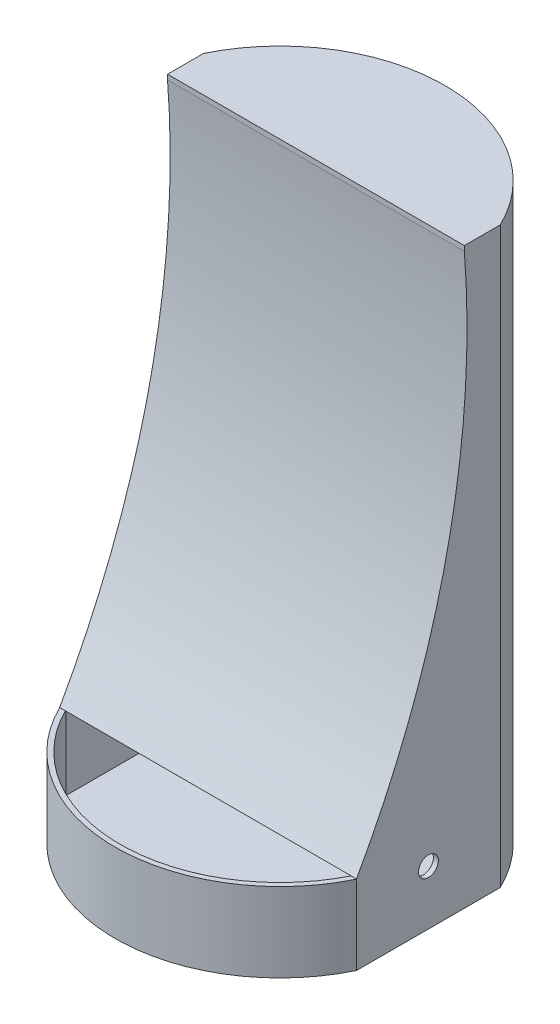
ISO-10303-21;
HEADER;
FILE_DESCRIPTION(('STEP AP214'),'2;1');
FILE_NAME('part.step','',(''),(''),'','','');
FILE_SCHEMA(('AUTOMOTIVE_DESIGN { 1 0 10303 214 1 1 1 1 }'));
ENDSEC;
DATA;
#1=APPLICATION_CONTEXT('core data for automotive mechanical design processes');
#2=APPLICATION_PROTOCOL_DEFINITION('international standard','automotive_design',2000,#1);
#3=PRODUCT_CONTEXT('',#1,'mechanical');
#4=PRODUCT('Part','Part','',(#3));
#5=PRODUCT_RELATED_PRODUCT_CATEGORY('part','',(#4));
#6=PRODUCT_DEFINITION_FORMATION('','',#4);
#7=PRODUCT_DEFINITION_CONTEXT('part definition',#1,'design');
#8=PRODUCT_DEFINITION('design','',#6,#7);
#9=PRODUCT_DEFINITION_SHAPE('','',#8);
#10=(LENGTH_UNIT() NAMED_UNIT(*) SI_UNIT(.MILLI.,.METRE.));
#11=(NAMED_UNIT(*) PLANE_ANGLE_UNIT() SI_UNIT($,.RADIAN.));
#12=(NAMED_UNIT(*) SI_UNIT($,.STERADIAN.) SOLID_ANGLE_UNIT());
#13=UNCERTAINTY_MEASURE_WITH_UNIT(LENGTH_MEASURE(1.E-05),#10,'distance_accuracy_value','');
#14=(GEOMETRIC_REPRESENTATION_CONTEXT(3) GLOBAL_UNCERTAINTY_ASSIGNED_CONTEXT((#13)) GLOBAL_UNIT_ASSIGNED_CONTEXT((#10,
#11,#12)) REPRESENTATION_CONTEXT('',''));
#15=CARTESIAN_POINT('',(0.,0.,0.));
#16=DIRECTION('',(0.,0.,1.));
#17=DIRECTION('',(1.,0.,0.));
#18=AXIS2_PLACEMENT_3D('',#15,#16,#17);
#19=CARTESIAN_POINT('',(87.,48.,-42.8952211790544));
#20=DIRECTION('',(1.,0.,0.));
#21=DIRECTION('',(0.,0.,-1.));
#22=AXIS2_PLACEMENT_3D('',#19,#20,#21);
#23=PLANE('',#22);
#24=CARTESIAN_POINT('',(87.,33.,0.));
#25=DIRECTION('',(1.,0.,0.));
#26=DIRECTION('',(0.,0.,-1.));
#27=AXIS2_PLACEMENT_3D('',#24,#25,#26);
#28=CIRCLE('',#27,6.);
#29=CARTESIAN_POINT('',(87.,33.,-6.00000000000001));
#30=VERTEX_POINT('',#29);
#31=EDGE_CURVE('E304',#30,#30,#28,.T.);
#32=ORIENTED_EDGE('',*,*,#31,.T.);
#33=EDGE_LOOP('',(#32));
#34=FACE_BOUND('',#33,.T.);
#35=DIRECTION('',(0.,-0.83062562422528,0.55683127819867));
#36=VECTOR('',#35,1.);
#37=CARTESIAN_POINT('',(87.,88.0542581905071,16.8537450068936));
#38=LINE('',#37,#36);
#39=CARTESIAN_POINT('',(87.,50.6279210575118,41.9434539398412));
#40=VERTEX_POINT('',#39);
#41=CARTESIAN_POINT('',(87.,49.0667688825623,42.990012504478));
#42=VERTEX_POINT('',#41);
#43=EDGE_CURVE('E238',#40,#42,#38,.T.);
#44=ORIENTED_EDGE('',*,*,#43,.F.);
#45=CARTESIAN_POINT('',(87.0000000000001,304.085663032172,498.891262140153));
#46=DIRECTION('',(1.,0.,0.));
#47=DIRECTION('',(0.,0.,-1.));
#48=AXIS2_PLACEMENT_3D('',#45,#46,#47);
#49=CIRCLE('',#48,522.534330342);
#50=CARTESIAN_POINT('',(87.,345.,-22.0388132216422));
#51=VERTEX_POINT('',#50);
#52=EDGE_CURVE('E228',#40,#51,#49,.T.);
#53=ORIENTED_EDGE('',*,*,#52,.T.);
#54=DIRECTION('',(0.,0.,1.));
#55=VECTOR('',#54,1.);
#56=CARTESIAN_POINT('',(87.,345.,-42.8952211790544));
#57=LINE('',#56,#55);
#58=CARTESIAN_POINT('',(87.,345.,-43.5889894354068));
#59=VERTEX_POINT('',#58);
#60=EDGE_CURVE('E244',#59,#51,#57,.T.);
#61=ORIENTED_EDGE('',*,*,#60,.F.);
#62=DIRECTION('',(0.,1.,0.));
#63=VECTOR('',#62,1.);
#64=CARTESIAN_POINT('',(87.,348.,-43.5889894354068));
#65=LINE('',#64,#63);
#66=CARTESIAN_POINT('',(87.,48.,-43.5889894354068));
#67=VERTEX_POINT('',#66);
#68=EDGE_CURVE('E437',#67,#59,#65,.T.);
#69=ORIENTED_EDGE('',*,*,#68,.F.);
#70=DIRECTION('',(0.,0.,-1.));
#71=VECTOR('',#70,1.);
#72=CARTESIAN_POINT('',(87.,48.,-43.5889894354068));
#73=LINE('',#72,#71);
#74=CARTESIAN_POINT('',(87.,48.,-42.8952211790544));
#75=VERTEX_POINT('',#74);
#76=EDGE_CURVE('E345',#75,#67,#73,.T.);
#77=ORIENTED_EDGE('',*,*,#76,.F.);
#78=DIRECTION('',(0.,-1.,0.));
#79=VECTOR('',#78,1.);
#80=CARTESIAN_POINT('',(87.,48.,-42.8952211790544));
#81=LINE('',#80,#79);
#82=CARTESIAN_POINT('',(87.,3.00000000000001,-42.8952211790544));
#83=VERTEX_POINT('',#82);
#84=EDGE_CURVE('E360',#75,#83,#81,.T.);
#85=ORIENTED_EDGE('',*,*,#84,.T.);
#86=DIRECTION('',(0.,0.,1.));
#87=VECTOR('',#86,1.);
#88=CARTESIAN_POINT('',(87.,3.,-42.8952211790544));
#89=LINE('',#88,#87);
#90=CARTESIAN_POINT('',(87.,3.00000000000001,42.8952211790544));
#91=VERTEX_POINT('',#90);
#92=EDGE_CURVE('E364',#83,#91,#89,.T.);
#93=ORIENTED_EDGE('',*,*,#92,.T.);
#94=DIRECTION('',(0.,-1.,0.));
#95=VECTOR('',#94,1.);
#96=CARTESIAN_POINT('',(87.,48.,42.8952211790544));
#97=LINE('',#96,#95);
#98=CARTESIAN_POINT('',(87.,48.,42.8952211790544));
#99=VERTEX_POINT('',#98);
#100=EDGE_CURVE('E363',#99,#91,#97,.T.);
#101=ORIENTED_EDGE('',*,*,#100,.F.);
#102=CARTESIAN_POINT('',(87.,47.9999999999999,43.5889894354068));
#103=VERTEX_POINT('',#102);
#104=EDGE_CURVE('E355',#103,#99,#73,.T.);
#105=ORIENTED_EDGE('',*,*,#104,.F.);
#106=CARTESIAN_POINT('',(87.0000000000001,304.360872522258,498.914399854991));
#107=DIRECTION('',(-1.,0.,0.));
#108=DIRECTION('',(0.,0.,-1.));
#109=AXIS2_PLACEMENT_3D('',#106,#107,#108);
#110=CIRCLE('',#109,522.534330292409);
#111=EDGE_CURVE('E351',#42,#103,#110,.T.);
#112=ORIENTED_EDGE('',*,*,#111,.F.);
#113=EDGE_LOOP('',(#44,#53,#61,#69,#77,#85,#93,#101,#105,#112));
#114=FACE_BOUND('',#113,.T.);
#115=ADVANCED_FACE('F72',(#34,#114),#23,.F.);
#116=CARTESIAN_POINT('',(87.0000000000001,304.360872522258,498.914399854991));
#117=DIRECTION('',(1.,0.,0.));
#118=DIRECTION('',(0.,0.,-1.));
#119=AXIS2_PLACEMENT_3D('',#116,#117,#118);
#120=CYLINDRICAL_SURFACE('',#119,522.534330292409);
#121=CARTESIAN_POINT('',(90.0000000000001,304.360872522258,498.914399854991));
#122=DIRECTION('',(-1.,0.,0.));
#123=DIRECTION('',(0.,0.,-1.));
#124=AXIS2_PLACEMENT_3D('',#121,#122,#123);
#125=CIRCLE('',#124,522.534330292409);
#126=CARTESIAN_POINT('',(90.,49.0667688825623,42.990012504478));
#127=VERTEX_POINT('',#126);
#128=CARTESIAN_POINT('',(90.,47.9999999999999,43.5889894354068));
#129=VERTEX_POINT('',#128);
#130=EDGE_CURVE('E434',#127,#129,#125,.T.);
#131=ORIENTED_EDGE('',*,*,#130,.F.);
#132=DIRECTION('',(1.,0.,0.));
#133=VECTOR('',#132,1.);
#134=CARTESIAN_POINT('',(87.0000000000001,49.0667688825623,42.990012504478));
#135=LINE('',#134,#133);
#136=EDGE_CURVE('E206',#127,#42,#135,.F.);
#137=ORIENTED_EDGE('',*,*,#136,.T.);
#138=ORIENTED_EDGE('',*,*,#111,.T.);
#139=DIRECTION('',(1.,0.,0.));
#140=VECTOR('',#139,1.);
#141=CARTESIAN_POINT('',(87.,47.9999999999999,43.5889894354068));
#142=LINE('',#141,#140);
#143=EDGE_CURVE('E383',#103,#129,#142,.T.);
#144=ORIENTED_EDGE('',*,*,#143,.T.);
#145=EDGE_LOOP('',(#131,#137,#138,#144));
#146=FACE_BOUND('',#145,.T.);
#147=ADVANCED_FACE('F432',(#146),#120,.F.);
#148=CARTESIAN_POINT('',(-86.9999999999998,304.085663032172,498.891262140153));
#149=DIRECTION('',(-1.,0.,0.));
#150=DIRECTION('',(0.,0.,1.));
#151=AXIS2_PLACEMENT_3D('',#148,#149,#150);
#152=CYLINDRICAL_SURFACE('',#151,522.534330342);
#153=CARTESIAN_POINT('',(-86.9999999999998,304.085663032172,498.891262140153));
#154=DIRECTION('',(1.,0.,0.));
#155=DIRECTION('',(0.,0.,1.));
#156=AXIS2_PLACEMENT_3D('',#153,#154,#155);
#157=CIRCLE('',#156,522.534330342);
#158=CARTESIAN_POINT('',(-87.,48.,43.4110105645932));
#159=VERTEX_POINT('',#158);
#160=CARTESIAN_POINT('',(-86.9999999999999,50.6279210575118,41.9434539398412));
#161=VERTEX_POINT('',#160);
#162=EDGE_CURVE('E259',#159,#161,#157,.T.);
#163=ORIENTED_EDGE('',*,*,#162,.T.);
#164=DIRECTION('',(-1.,0.,0.));
#165=VECTOR('',#164,1.);
#166=CARTESIAN_POINT('',(90.,50.6279210575118,41.9434539398412));
#167=LINE('',#166,#165);
#168=CARTESIAN_POINT('',(-90.,50.6279210575118,41.9434539398411));
#169=VERTEX_POINT('',#168);
#170=EDGE_CURVE('E210',#161,#169,#167,.T.);
#171=ORIENTED_EDGE('',*,*,#170,.T.);
#172=CARTESIAN_POINT('',(-89.9999999999998,304.085663032172,498.891262140153));
#173=DIRECTION('',(1.,0.,0.));
#174=DIRECTION('',(0.,0.,1.));
#175=AXIS2_PLACEMENT_3D('',#172,#173,#174);
#176=CIRCLE('',#175,522.534330342);
#177=CARTESIAN_POINT('',(-90.,48.,43.4110105645932));
#178=VERTEX_POINT('',#177);
#179=EDGE_CURVE('E258',#178,#169,#176,.T.);
#180=ORIENTED_EDGE('',*,*,#179,.F.);
#181=DIRECTION('',(-1.,0.,0.));
#182=VECTOR('',#181,1.);
#183=CARTESIAN_POINT('',(-87.,48.,43.4110105645932));
#184=LINE('',#183,#182);
#185=EDGE_CURVE('E275',#159,#178,#184,.T.);
#186=ORIENTED_EDGE('',*,*,#185,.F.);
#187=EDGE_LOOP('',(#163,#171,#180,#186));
#188=FACE_BOUND('',#187,.T.);
#189=ADVANCED_FACE('F288',(#188),#152,.F.);
#190=CARTESIAN_POINT('',(-87.,48.,-42.8952211790544));
#191=DIRECTION('',(1.,0.,0.));
#192=DIRECTION('',(0.,0.,-1.));
#193=AXIS2_PLACEMENT_3D('',#190,#191,#192);
#194=PLANE('',#193);
#195=CARTESIAN_POINT('',(-87.,33.,0.));
#196=DIRECTION('',(1.,0.,0.));
#197=DIRECTION('',(0.,0.,-1.));
#198=AXIS2_PLACEMENT_3D('',#195,#196,#197);
#199=CIRCLE('',#198,6.);
#200=CARTESIAN_POINT('',(-87.,33.,6.00000000000003));
#201=VERTEX_POINT('',#200);
#202=EDGE_CURVE('E309',#201,#201,#199,.F.);
#203=ORIENTED_EDGE('',*,*,#202,.T.);
#204=EDGE_LOOP('',(#203));
#205=FACE_BOUND('',#204,.T.);
#206=DIRECTION('',(0.,-1.,0.));
#207=VECTOR('',#206,1.);
#208=CARTESIAN_POINT('',(-87.,48.,-43.5889894354068));
#209=LINE('',#208,#207);
#210=CARTESIAN_POINT('',(-87.,345.,-43.5889894354067));
#211=VERTEX_POINT('',#210);
#212=CARTESIAN_POINT('',(-87.,48.,-43.5889894354068));
#213=VERTEX_POINT('',#212);
#214=EDGE_CURVE('E262',#211,#213,#209,.T.);
#215=ORIENTED_EDGE('',*,*,#214,.F.);
#216=DIRECTION('',(0.,0.,1.));
#217=VECTOR('',#216,1.);
#218=CARTESIAN_POINT('',(-87.,345.,-42.8952211790544));
#219=LINE('',#218,#217);
#220=CARTESIAN_POINT('',(-87.,345.,-22.0388132216421));
#221=VERTEX_POINT('',#220);
#222=EDGE_CURVE('E249',#211,#221,#219,.T.);
#223=ORIENTED_EDGE('',*,*,#222,.T.);
#224=EDGE_CURVE('E87',#161,#221,#157,.T.);
#225=ORIENTED_EDGE('',*,*,#224,.F.);
#226=ORIENTED_EDGE('',*,*,#162,.F.);
#227=DIRECTION('',(0.,0.,1.));
#228=VECTOR('',#227,1.);
#229=CARTESIAN_POINT('',(-87.,48.,43.4110105645932));
#230=LINE('',#229,#228);
#231=CARTESIAN_POINT('',(-87.,48.,42.8952211790545));
#232=VERTEX_POINT('',#231);
#233=EDGE_CURVE('E265',#232,#159,#230,.T.);
#234=ORIENTED_EDGE('',*,*,#233,.F.);
#235=DIRECTION('',(0.,-1.,0.));
#236=VECTOR('',#235,1.);
#237=CARTESIAN_POINT('',(-87.,48.,42.8952211790545));
#238=LINE('',#237,#236);
#239=CARTESIAN_POINT('',(-87.,3.00000000000001,42.8952211790545));
#240=VERTEX_POINT('',#239);
#241=EDGE_CURVE('E393',#232,#240,#238,.T.);
#242=ORIENTED_EDGE('',*,*,#241,.T.);
#243=DIRECTION('',(0.,0.,1.));
#244=VECTOR('',#243,1.);
#245=CARTESIAN_POINT('',(-87.,3.,-42.8952211790544));
#246=LINE('',#245,#244);
#247=CARTESIAN_POINT('',(-87.,3.00000000000001,-42.8952211790544));
#248=VERTEX_POINT('',#247);
#249=EDGE_CURVE('E375',#248,#240,#246,.T.);
#250=ORIENTED_EDGE('',*,*,#249,.F.);
#251=DIRECTION('',(0.,-1.,0.));
#252=VECTOR('',#251,1.);
#253=CARTESIAN_POINT('',(-87.,48.,-42.8952211790544));
#254=LINE('',#253,#252);
#255=CARTESIAN_POINT('',(-87.,48.,-42.8952211790544));
#256=VERTEX_POINT('',#255);
#257=EDGE_CURVE('E372',#256,#248,#254,.T.);
#258=ORIENTED_EDGE('',*,*,#257,.F.);
#259=EDGE_CURVE('E273',#213,#256,#230,.T.);
#260=ORIENTED_EDGE('',*,*,#259,.F.);
#261=EDGE_LOOP('',(#215,#223,#225,#226,#234,#242,#250,#258,#260));
#262=FACE_BOUND('',#261,.T.);
#263=ADVANCED_FACE('F416',(#205,#262),#194,.T.);
#264=CARTESIAN_POINT('',(0.,48.,2.63677968348475E-13));
#265=DIRECTION('',(0.,1.,0.));
#266=DIRECTION('',(0.,0.,1.));
#267=AXIS2_PLACEMENT_3D('',#264,#265,#266);
#268=CYLINDRICAL_SURFACE('',#267,97.3087868591527);
#269=CARTESIAN_POINT('',(0.,345.,2.63677968348475E-13));
#270=DIRECTION('',(0.,1.,0.));
#271=DIRECTION('',(0.,0.,1.));
#272=AXIS2_PLACEMENT_3D('',#269,#270,#271);
#273=CIRCLE('',#272,97.3087868591527);
#274=EDGE_CURVE('E80',#211,#59,#273,.F.);
#275=ORIENTED_EDGE('',*,*,#274,.F.);
#276=ORIENTED_EDGE('',*,*,#214,.T.);
#277=CARTESIAN_POINT('',(0.,48.,2.63677968348475E-13));
#278=DIRECTION('',(0.,1.,0.));
#279=DIRECTION('',(0.905776372770693,0.,-0.423756017692218));
#280=AXIS2_PLACEMENT_3D('',#277,#278,#279);
#281=CIRCLE('',#280,97.3087868591527);
#282=EDGE_CURVE('E252',#67,#213,#281,.T.);
#283=ORIENTED_EDGE('',*,*,#282,.F.);
#284=ORIENTED_EDGE('',*,*,#68,.T.);
#285=EDGE_LOOP('',(#275,#276,#283,#284));
#286=FACE_BOUND('',#285,.T.);
#287=ADVANCED_FACE('F468',(#286),#268,.F.);
#288=CARTESIAN_POINT('',(0.,48.,0.));
#289=DIRECTION('',(0.,1.,0.));
#290=DIRECTION('',(0.,0.,1.));
#291=AXIS2_PLACEMENT_3D('',#288,#289,#290);
#292=PLANE('',#291);
#293=ORIENTED_EDGE('',*,*,#76,.T.);
#294=ORIENTED_EDGE('',*,*,#282,.T.);
#295=ORIENTED_EDGE('',*,*,#259,.T.);
#296=CARTESIAN_POINT('',(0.,48.,2.63677968348475E-13));
#297=DIRECTION('',(0.,1.,0.));
#298=DIRECTION('',(0.,0.,1.));
#299=AXIS2_PLACEMENT_3D('',#296,#297,#298);
#300=CIRCLE('',#299,97.0000000000001);
#301=EDGE_CURVE('E317',#75,#256,#300,.T.);
#302=ORIENTED_EDGE('',*,*,#301,.F.);
#303=EDGE_LOOP('',(#293,#294,#295,#302));
#304=FACE_BOUND('',#303,.T.);
#305=ADVANCED_FACE('F423',(#304),#292,.T.);
#306=ORIENTED_EDGE('',*,*,#185,.T.);
#307=DIRECTION('',(-1.,0.,0.));
#308=VECTOR('',#307,1.);
#309=CARTESIAN_POINT('',(-87.,48.,43.4110105645932));
#310=LINE('',#309,#308);
#311=CARTESIAN_POINT('',(-90.0859820491556,48.,43.4110105645932));
#312=VERTEX_POINT('',#311);
#313=EDGE_CURVE('E296',#178,#312,#310,.T.);
#314=ORIENTED_EDGE('',*,*,#313,.T.);
#315=CARTESIAN_POINT('',(0.,48.,0.));
#316=DIRECTION('',(0.,1.,0.));
#317=DIRECTION('',(0.,0.,1.));
#318=AXIS2_PLACEMENT_3D('',#315,#316,#317);
#319=CIRCLE('',#318,100.);
#320=EDGE_CURVE('E303',#312,#129,#319,.T.);
#321=ORIENTED_EDGE('',*,*,#320,.T.);
#322=ORIENTED_EDGE('',*,*,#143,.F.);
#323=ORIENTED_EDGE('',*,*,#104,.T.);
#324=CARTESIAN_POINT('',(0.,48.,0.));
#325=DIRECTION('',(0.,1.,0.));
#326=DIRECTION('',(0.,0.,1.));
#327=AXIS2_PLACEMENT_3D('',#324,#325,#326);
#328=CIRCLE('',#327,97.);
#329=EDGE_CURVE('E388',#232,#99,#328,.T.);
#330=ORIENTED_EDGE('',*,*,#329,.F.);
#331=ORIENTED_EDGE('',*,*,#233,.T.);
#332=EDGE_LOOP('',(#306,#314,#321,#322,#323,#330,#331));
#333=FACE_BOUND('',#332,.T.);
#334=ADVANCED_FACE('F294',(#333),#292,.T.);
#335=CARTESIAN_POINT('',(0.,3.,0.));
#336=DIRECTION('',(0.,-1.,0.));
#337=DIRECTION('',(0.,0.,-1.));
#338=AXIS2_PLACEMENT_3D('',#335,#336,#337);
#339=CYLINDRICAL_SURFACE('',#338,100.);
#340=DIRECTION('',(0.,-1.,0.));
#341=VECTOR('',#340,1.);
#342=CARTESIAN_POINT('',(90.,48.,-43.5889894354068));
#343=LINE('',#342,#341);
#344=CARTESIAN_POINT('',(90.,348.,-43.5889894354068));
#345=VERTEX_POINT('',#344);
#346=CARTESIAN_POINT('',(90.,0.,-43.5889894354068));
#347=VERTEX_POINT('',#346);
#348=EDGE_CURVE('E330',#345,#347,#343,.T.);
#349=ORIENTED_EDGE('',*,*,#348,.T.);
#350=CARTESIAN_POINT('',(0.,0.,0.));
#351=DIRECTION('',(0.,1.,0.));
#352=DIRECTION('',(0.,0.,1.));
#353=AXIS2_PLACEMENT_3D('',#350,#351,#352);
#354=CIRCLE('',#353,100.);
#355=CARTESIAN_POINT('',(-90.,0.,-43.5889894354068));
#356=VERTEX_POINT('',#355);
#357=EDGE_CURVE('E333',#347,#356,#354,.T.);
#358=ORIENTED_EDGE('',*,*,#357,.T.);
#359=DIRECTION('',(0.,-1.,0.));
#360=VECTOR('',#359,1.);
#361=CARTESIAN_POINT('',(-90.,48.,-43.5889894354068));
#362=LINE('',#361,#360);
#363=CARTESIAN_POINT('',(-90.,348.,-43.5889894354067));
#364=VERTEX_POINT('',#363);
#365=EDGE_CURVE('E327',#364,#356,#362,.T.);
#366=ORIENTED_EDGE('',*,*,#365,.F.);
#367=CARTESIAN_POINT('',(0.,348.,2.63677968348475E-13));
#368=DIRECTION('',(0.,1.,0.));
#369=DIRECTION('',(0.899999999999997,0.,-0.435889894354074));
#370=AXIS2_PLACEMENT_3D('',#367,#368,#369);
#371=CIRCLE('',#370,100.);
#372=EDGE_CURVE('E255',#345,#364,#371,.T.);
#373=ORIENTED_EDGE('',*,*,#372,.F.);
#374=EDGE_LOOP('',(#349,#358,#366,#373));
#375=FACE_BOUND('',#374,.T.);
#376=ADVANCED_FACE('F487',(#375),#339,.T.);
#377=DIRECTION('',(0.,-1.,0.));
#378=VECTOR('',#377,1.);
#379=CARTESIAN_POINT('',(90.,3.,43.5889894354068));
#380=LINE('',#379,#378);
#381=CARTESIAN_POINT('',(90.,0.,43.5889894354068));
#382=VERTEX_POINT('',#381);
#383=EDGE_CURVE('E324',#382,#129,#380,.F.);
#384=ORIENTED_EDGE('',*,*,#383,.T.);
#385=ORIENTED_EDGE('',*,*,#320,.F.);
#386=DIRECTION('',(0.,-1.,0.));
#387=VECTOR('',#386,1.);
#388=CARTESIAN_POINT('',(-90.0859820491555,3.,43.4110105645932));
#389=LINE('',#388,#387);
#390=CARTESIAN_POINT('',(-90.0859820491556,0.,43.4110105645932));
#391=VERTEX_POINT('',#390);
#392=EDGE_CURVE('E302',#312,#391,#389,.T.);
#393=ORIENTED_EDGE('',*,*,#392,.T.);
#394=EDGE_CURVE('E332',#391,#382,#354,.T.);
#395=ORIENTED_EDGE('',*,*,#394,.T.);
#396=EDGE_LOOP('',(#384,#385,#393,#395));
#397=FACE_BOUND('',#396,.T.);
#398=ADVANCED_FACE('F74',(#397),#339,.T.);
#399=CARTESIAN_POINT('',(0.,0.,0.));
#400=DIRECTION('',(0.,1.,0.));
#401=DIRECTION('',(0.,0.,1.));
#402=AXIS2_PLACEMENT_3D('',#399,#400,#401);
#403=PLANE('',#402);
#404=DIRECTION('',(1.,0.,0.));
#405=VECTOR('',#404,1.);
#406=CARTESIAN_POINT('',(0.,0.,43.4110105645932));
#407=LINE('',#406,#405);
#408=CARTESIAN_POINT('',(-90.,0.,43.4110105645932));
#409=VERTEX_POINT('',#408);
#410=EDGE_CURVE('E339',#391,#409,#407,.T.);
#411=ORIENTED_EDGE('',*,*,#410,.T.);
#412=DIRECTION('',(0.,0.,-1.));
#413=VECTOR('',#412,1.);
#414=CARTESIAN_POINT('',(-90.,0.,0.));
#415=LINE('',#414,#413);
#416=EDGE_CURVE('E342',#409,#356,#415,.T.);
#417=ORIENTED_EDGE('',*,*,#416,.T.);
#418=ORIENTED_EDGE('',*,*,#357,.F.);
#419=DIRECTION('',(0.,0.,1.));
#420=VECTOR('',#419,1.);
#421=CARTESIAN_POINT('',(90.,0.,0.));
#422=LINE('',#421,#420);
#423=EDGE_CURVE('E336',#347,#382,#422,.T.);
#424=ORIENTED_EDGE('',*,*,#423,.T.);
#425=ORIENTED_EDGE('',*,*,#394,.F.);
#426=EDGE_LOOP('',(#411,#417,#418,#424,#425));
#427=FACE_BOUND('',#426,.T.);
#428=ADVANCED_FACE('F489',(#427),#403,.F.);
#429=CARTESIAN_POINT('',(90.,48.,-43.5889894354068));
#430=DIRECTION('',(1.,0.,0.));
#431=DIRECTION('',(0.,0.,-1.));
#432=AXIS2_PLACEMENT_3D('',#429,#430,#431);
#433=PLANE('',#432);
#434=DIRECTION('',(0.,0.,1.));
#435=VECTOR('',#434,1.);
#436=CARTESIAN_POINT('',(90.,348.,-21.7944947177034));
#437=LINE('',#436,#435);
#438=CARTESIAN_POINT('',(90.,348.,-21.7944947177034));
#439=VERTEX_POINT('',#438);
#440=EDGE_CURVE('E277',#345,#439,#437,.T.);
#441=ORIENTED_EDGE('',*,*,#440,.T.);
#442=DIRECTION('',(0.,1.,0.));
#443=VECTOR('',#442,1.);
#444=CARTESIAN_POINT('',(90.,345.,-21.7944947177034));
#445=LINE('',#444,#443);
#446=CARTESIAN_POINT('',(90.,345.,-21.7944947177033));
#447=VERTEX_POINT('',#446);
#448=EDGE_CURVE('E225',#447,#439,#445,.T.);
#449=ORIENTED_EDGE('',*,*,#448,.F.);
#450=CARTESIAN_POINT('',(90.0000000000002,304.085663032172,498.891262140153));
#451=DIRECTION('',(1.,0.,0.));
#452=DIRECTION('',(0.,-0.490051973597019,-0.871693216202619));
#453=AXIS2_PLACEMENT_3D('',#450,#451,#452);
#454=CIRCLE('',#453,522.290762281083);
#455=CARTESIAN_POINT('',(90.,48.136044184836,43.6139477744372));
#456=VERTEX_POINT('',#455);
#457=EDGE_CURVE('E215',#456,#447,#454,.T.);
#458=ORIENTED_EDGE('',*,*,#457,.F.);
#459=DIRECTION('',(0.,0.83062562422528,-0.55683127819867));
#460=VECTOR('',#459,1.);
#461=CARTESIAN_POINT('',(90.,48.136044184836,43.6139477744372));
#462=LINE('',#461,#460);
#463=EDGE_CURVE('E199',#456,#127,#462,.T.);
#464=ORIENTED_EDGE('',*,*,#463,.T.);
#465=ORIENTED_EDGE('',*,*,#130,.T.);
#466=ORIENTED_EDGE('',*,*,#383,.F.);
#467=ORIENTED_EDGE('',*,*,#423,.F.);
#468=ORIENTED_EDGE('',*,*,#348,.F.);
#469=EDGE_LOOP('',(#441,#449,#458,#464,#465,#466,#467,#468));
#470=FACE_BOUND('',#469,.T.);
#471=CARTESIAN_POINT('',(90.,33.,0.));
#472=DIRECTION('',(1.,0.,0.));
#473=DIRECTION('',(0.,0.,-1.));
#474=AXIS2_PLACEMENT_3D('',#471,#472,#473);
#475=CIRCLE('',#474,6.);
#476=CARTESIAN_POINT('',(90.,33.,-6.00000000000001));
#477=VERTEX_POINT('',#476);
#478=EDGE_CURVE('E306',#477,#477,#475,.T.);
#479=ORIENTED_EDGE('',*,*,#478,.F.);
#480=EDGE_LOOP('',(#479));
#481=FACE_BOUND('',#480,.T.);
#482=ADVANCED_FACE('F222',(#470,#481),#433,.T.);
#483=CARTESIAN_POINT('',(-90.,48.,-43.5889894354068));
#484=DIRECTION('',(1.,0.,0.));
#485=DIRECTION('',(0.,0.,-1.));
#486=AXIS2_PLACEMENT_3D('',#483,#484,#485);
#487=PLANE('',#486);
#488=CARTESIAN_POINT('',(-89.9999999999998,304.085663032172,498.891262140153));
#489=DIRECTION('',(1.,0.,0.));
#490=DIRECTION('',(0.,-0.490051973597019,-0.87169321620262));
#491=AXIS2_PLACEMENT_3D('',#488,#489,#490);
#492=CIRCLE('',#491,522.290762281084);
#493=CARTESIAN_POINT('',(-90.,48.1360441848359,43.6139477744372));
#494=VERTEX_POINT('',#493);
#495=CARTESIAN_POINT('',(-90.,345.,-21.7944947177033));
#496=VERTEX_POINT('',#495);
#497=EDGE_CURVE('E218',#494,#496,#492,.T.);
#498=ORIENTED_EDGE('',*,*,#497,.T.);
#499=DIRECTION('',(0.,1.,0.));
#500=VECTOR('',#499,1.);
#501=CARTESIAN_POINT('',(-90.,345.,-21.7944947177033));
#502=LINE('',#501,#500);
#503=CARTESIAN_POINT('',(-90.,348.,-21.7944947177033));
#504=VERTEX_POINT('',#503);
#505=EDGE_CURVE('E242',#496,#504,#502,.T.);
#506=ORIENTED_EDGE('',*,*,#505,.T.);
#507=DIRECTION('',(0.,0.,-1.));
#508=VECTOR('',#507,1.);
#509=CARTESIAN_POINT('',(-90.,348.,-43.5889894354067));
#510=LINE('',#509,#508);
#511=EDGE_CURVE('E263',#504,#364,#510,.T.);
#512=ORIENTED_EDGE('',*,*,#511,.T.);
#513=ORIENTED_EDGE('',*,*,#365,.T.);
#514=ORIENTED_EDGE('',*,*,#416,.F.);
#515=DIRECTION('',(0.,-1.,0.));
#516=VECTOR('',#515,1.);
#517=CARTESIAN_POINT('',(-90.,48.,43.4110105645932));
#518=LINE('',#517,#516);
#519=EDGE_CURVE('E286',#178,#409,#518,.T.);
#520=ORIENTED_EDGE('',*,*,#519,.F.);
#521=ORIENTED_EDGE('',*,*,#179,.T.);
#522=DIRECTION('',(0.,-0.83062562422528,0.55683127819867));
#523=VECTOR('',#522,1.);
#524=CARTESIAN_POINT('',(-90.,50.6279210575118,41.9434539398412));
#525=LINE('',#524,#523);
#526=EDGE_CURVE('E219',#169,#494,#525,.T.);
#527=ORIENTED_EDGE('',*,*,#526,.T.);
#528=EDGE_LOOP('',(#498,#506,#512,#513,#514,#520,#521,#527));
#529=FACE_BOUND('',#528,.T.);
#530=CARTESIAN_POINT('',(-90.,33.,0.));
#531=DIRECTION('',(-1.,0.,0.));
#532=DIRECTION('',(0.,0.,1.));
#533=AXIS2_PLACEMENT_3D('',#530,#531,#532);
#534=CIRCLE('',#533,6.);
#535=CARTESIAN_POINT('',(-90.,33.,6.00000000000003));
#536=VERTEX_POINT('',#535);
#537=EDGE_CURVE('E319',#536,#536,#534,.T.);
#538=ORIENTED_EDGE('',*,*,#537,.F.);
#539=EDGE_LOOP('',(#538));
#540=FACE_BOUND('',#539,.T.);
#541=ADVANCED_FACE('F283',(#529,#540),#487,.F.);
#542=CARTESIAN_POINT('',(-90.,-42.,43.4110105645932));
#543=DIRECTION('',(0.,0.,1.));
#544=DIRECTION('',(1.,0.,0.));
#545=AXIS2_PLACEMENT_3D('',#542,#543,#544);
#546=PLANE('',#545);
#547=ORIENTED_EDGE('',*,*,#392,.F.);
#548=ORIENTED_EDGE('',*,*,#313,.F.);
#549=ORIENTED_EDGE('',*,*,#519,.T.);
#550=ORIENTED_EDGE('',*,*,#410,.F.);
#551=EDGE_LOOP('',(#547,#548,#549,#550));
#552=FACE_BOUND('',#551,.T.);
#553=ADVANCED_FACE('F300',(#552),#546,.F.);
#554=CARTESIAN_POINT('',(-45.,33.,0.));
#555=DIRECTION('',(-1.,0.,0.));
#556=DIRECTION('',(0.,0.,1.));
#557=AXIS2_PLACEMENT_3D('',#554,#555,#556);
#558=CYLINDRICAL_SURFACE('',#557,6.);
#559=CARTESIAN_POINT('',(-87.,33.,6.00000000000003));
#560=CARTESIAN_POINT('',(-87.03125,33.,6.00000000000003));
#561=CARTESIAN_POINT('',(-87.0625,33.,6.00000000000003));
#562=CARTESIAN_POINT('',(-87.125,33.,6.00000000000003));
#563=CARTESIAN_POINT('',(-87.15625,33.,6.00000000000003));
#564=CARTESIAN_POINT('',(-87.21875,33.,6.00000000000003));
#565=CARTESIAN_POINT('',(-87.25,33.,6.00000000000003));
#566=CARTESIAN_POINT('',(-87.3125,33.,6.00000000000003));
#567=CARTESIAN_POINT('',(-87.34375,33.,6.00000000000003));
#568=CARTESIAN_POINT('',(-87.4062499999999,33.,6.00000000000003));
#569=CARTESIAN_POINT('',(-87.4375,33.,6.00000000000003));
#570=CARTESIAN_POINT('',(-87.5,33.,6.00000000000003));
#571=CARTESIAN_POINT('',(-87.53125,33.,6.00000000000003));
#572=CARTESIAN_POINT('',(-87.59375,33.,6.00000000000003));
#573=CARTESIAN_POINT('',(-87.625,33.,6.00000000000003));
#574=CARTESIAN_POINT('',(-87.6875,33.,6.00000000000003));
#575=CARTESIAN_POINT('',(-87.71875,33.,6.00000000000003));
#576=CARTESIAN_POINT('',(-87.78125,33.,6.00000000000003));
#577=CARTESIAN_POINT('',(-87.8125,33.,6.00000000000003));
#578=CARTESIAN_POINT('',(-87.875,33.,6.00000000000003));
#579=CARTESIAN_POINT('',(-87.90625,33.,6.00000000000003));
#580=CARTESIAN_POINT('',(-87.96875,33.,6.00000000000003));
#581=CARTESIAN_POINT('',(-88.,33.,6.00000000000003));
#582=CARTESIAN_POINT('',(-88.0625,33.,6.00000000000003));
#583=CARTESIAN_POINT('',(-88.09375,33.,6.00000000000003));
#584=CARTESIAN_POINT('',(-88.15625,33.,6.00000000000003));
#585=CARTESIAN_POINT('',(-88.1875,33.,6.00000000000003));
#586=CARTESIAN_POINT('',(-88.25,33.,6.00000000000003));
#587=CARTESIAN_POINT('',(-88.28125,33.,6.00000000000003));
#588=CARTESIAN_POINT('',(-88.34375,33.,6.00000000000003));
#589=CARTESIAN_POINT('',(-88.375,33.,6.00000000000003));
#590=CARTESIAN_POINT('',(-88.4375,33.,6.00000000000003));
#591=CARTESIAN_POINT('',(-88.46875,33.,6.00000000000003));
#592=CARTESIAN_POINT('',(-88.53125,33.,6.00000000000003));
#593=CARTESIAN_POINT('',(-88.5625,33.,6.00000000000003));
#594=CARTESIAN_POINT('',(-88.625,33.,6.00000000000003));
#595=CARTESIAN_POINT('',(-88.65625,33.,6.00000000000003));
#596=CARTESIAN_POINT('',(-88.71875,33.,6.00000000000003));
#597=CARTESIAN_POINT('',(-88.75,33.,6.00000000000003));
#598=CARTESIAN_POINT('',(-88.8125,33.,6.00000000000003));
#599=CARTESIAN_POINT('',(-88.84375,33.,6.00000000000003));
#600=CARTESIAN_POINT('',(-88.90625,33.,6.00000000000003));
#601=CARTESIAN_POINT('',(-88.9375,33.,6.00000000000003));
#602=CARTESIAN_POINT('',(-89.,33.,6.00000000000003));
#603=CARTESIAN_POINT('',(-89.03125,33.,6.00000000000003));
#604=CARTESIAN_POINT('',(-89.09375,33.,6.00000000000003));
#605=CARTESIAN_POINT('',(-89.125,33.,6.00000000000003));
#606=CARTESIAN_POINT('',(-89.1875,33.,6.00000000000003));
#607=CARTESIAN_POINT('',(-89.21875,33.,6.00000000000003));
#608=CARTESIAN_POINT('',(-89.28125,33.,6.00000000000003));
#609=CARTESIAN_POINT('',(-89.3125,33.,6.00000000000003));
#610=CARTESIAN_POINT('',(-89.375,33.,6.00000000000003));
#611=CARTESIAN_POINT('',(-89.40625,33.,6.00000000000003));
#612=CARTESIAN_POINT('',(-89.46875,33.,6.00000000000003));
#613=CARTESIAN_POINT('',(-89.5,33.,6.00000000000003));
#614=CARTESIAN_POINT('',(-89.5625,33.,6.00000000000003));
#615=CARTESIAN_POINT('',(-89.59375,33.,6.00000000000003));
#616=CARTESIAN_POINT('',(-89.65625,33.,6.00000000000003));
#617=CARTESIAN_POINT('',(-89.6875,33.,6.00000000000003));
#618=CARTESIAN_POINT('',(-89.75,33.,6.00000000000003));
#619=CARTESIAN_POINT('',(-89.78125,33.,6.00000000000003));
#620=CARTESIAN_POINT('',(-89.84375,33.,6.00000000000003));
#621=CARTESIAN_POINT('',(-89.875,33.,6.00000000000003));
#622=CARTESIAN_POINT('',(-89.9375,33.,6.00000000000003));
#623=CARTESIAN_POINT('',(-89.96875,33.,6.00000000000003));
#624=CARTESIAN_POINT('',(-90.,33.,6.00000000000003));
#625=B_SPLINE_CURVE_WITH_KNOTS('',3,(#559,#560,#561,#562,#563,#564,#565,#566,#567,#568,#569,
#570,#571,#572,#573,#574,#575,#576,#577,#578,#579,#580,#581,#582,#583,#584,#585,#586,#587,#588,
#589,#590,#591,#592,#593,#594,#595,#596,#597,#598,#599,#600,#601,#602,#603,#604,#605,#606,#607,
#608,#609,#610,#611,#612,#613,#614,#615,#616,#617,#618,#619,#620,#621,#622,#623,#624),
.UNSPECIFIED.,.F.,.F.,(4,2,2,2,2,2,2,2,2,2,2,2,2,2,2,2,2,2,2,2,2,2,2,2,2,2,2,2,2,2,2,2,4),(0.,
0.0937500000000036,0.187499999999993,0.281249999999997,0.374999999999986,0.46874999999999,
0.562499999999994,0.656249999999997,0.750000000000001,0.843750000000004,0.937500000000008,
1.03125,1.125,1.21874999999999,1.31249999999999,1.40625,1.5,1.59375,1.68750000000001,
1.78125000000001,1.875,1.96875000000001,2.06249999999999,2.15625,2.25,2.34375000000001,
2.43750000000001,2.53125000000001,2.62500000000002,2.71875000000001,2.81250000000001,2.90625,
3.),.UNSPECIFIED.);
#626=EDGE_CURVE('BSEAM476',#201,#536,#625,.T.);
#627=ORIENTED_EDGE('',*,*,#202,.F.);
#628=ORIENTED_EDGE('',*,*,#537,.T.);
#629=ORIENTED_EDGE('',*,*,#626,.T.);
#630=ORIENTED_EDGE('',*,*,#626,.F.);
#631=EDGE_LOOP('',(#627,#629,#628,#630));
#632=FACE_BOUND('',#631,.T.);
#633=ADVANCED_FACE('F476',(#632),#558,.F.);
#634=CARTESIAN_POINT('',(45.,33.,0.));
#635=DIRECTION('',(1.,0.,0.));
#636=DIRECTION('',(0.,0.,-1.));
#637=AXIS2_PLACEMENT_3D('',#634,#635,#636);
#638=CYLINDRICAL_SURFACE('',#637,6.);
#639=CARTESIAN_POINT('',(90.,33.,-6.00000000000001));
#640=CARTESIAN_POINT('',(89.96875,33.,-6.00000000000001));
#641=CARTESIAN_POINT('',(89.9375,33.,-6.00000000000001));
#642=CARTESIAN_POINT('',(89.875,33.,-6.00000000000001));
#643=CARTESIAN_POINT('',(89.84375,33.,-6.00000000000001));
#644=CARTESIAN_POINT('',(89.78125,33.,-6.00000000000001));
#645=CARTESIAN_POINT('',(89.75,33.,-6.00000000000001));
#646=CARTESIAN_POINT('',(89.6875,33.,-6.00000000000001));
#647=CARTESIAN_POINT('',(89.65625,33.,-6.00000000000001));
#648=CARTESIAN_POINT('',(89.59375,33.,-6.00000000000001));
#649=CARTESIAN_POINT('',(89.5625,33.,-6.00000000000001));
#650=CARTESIAN_POINT('',(89.5,33.,-6.00000000000001));
#651=CARTESIAN_POINT('',(89.46875,33.,-6.00000000000001));
#652=CARTESIAN_POINT('',(89.40625,33.,-6.00000000000001));
#653=CARTESIAN_POINT('',(89.375,33.,-6.00000000000001));
#654=CARTESIAN_POINT('',(89.3125,33.,-6.00000000000001));
#655=CARTESIAN_POINT('',(89.28125,33.,-6.00000000000001));
#656=CARTESIAN_POINT('',(89.21875,33.,-6.00000000000001));
#657=CARTESIAN_POINT('',(89.1875,33.,-6.00000000000001));
#658=CARTESIAN_POINT('',(89.125,33.,-6.00000000000001));
#659=CARTESIAN_POINT('',(89.09375,33.,-6.00000000000001));
#660=CARTESIAN_POINT('',(89.03125,33.,-6.00000000000001));
#661=CARTESIAN_POINT('',(89.,33.,-6.00000000000001));
#662=CARTESIAN_POINT('',(88.9375,33.,-6.00000000000001));
#663=CARTESIAN_POINT('',(88.90625,33.,-6.00000000000001));
#664=CARTESIAN_POINT('',(88.84375,33.,-6.00000000000001));
#665=CARTESIAN_POINT('',(88.8125,33.,-6.00000000000001));
#666=CARTESIAN_POINT('',(88.75,33.,-6.00000000000001));
#667=CARTESIAN_POINT('',(88.71875,33.,-6.00000000000001));
#668=CARTESIAN_POINT('',(88.65625,33.,-6.00000000000001));
#669=CARTESIAN_POINT('',(88.625,33.,-6.00000000000001));
#670=CARTESIAN_POINT('',(88.5625,33.,-6.00000000000001));
#671=CARTESIAN_POINT('',(88.53125,33.,-6.00000000000001));
#672=CARTESIAN_POINT('',(88.46875,33.,-6.00000000000001));
#673=CARTESIAN_POINT('',(88.4375,33.,-6.00000000000001));
#674=CARTESIAN_POINT('',(88.375,33.,-6.00000000000001));
#675=CARTESIAN_POINT('',(88.34375,33.,-6.00000000000001));
#676=CARTESIAN_POINT('',(88.28125,33.,-6.00000000000001));
#677=CARTESIAN_POINT('',(88.25,33.,-6.00000000000001));
#678=CARTESIAN_POINT('',(88.1875,33.,-6.00000000000001));
#679=CARTESIAN_POINT('',(88.15625,33.,-6.00000000000001));
#680=CARTESIAN_POINT('',(88.09375,33.,-6.00000000000001));
#681=CARTESIAN_POINT('',(88.0625,33.,-6.00000000000001));
#682=CARTESIAN_POINT('',(88.,33.,-6.00000000000001));
#683=CARTESIAN_POINT('',(87.96875,33.,-6.00000000000001));
#684=CARTESIAN_POINT('',(87.90625,33.,-6.00000000000001));
#685=CARTESIAN_POINT('',(87.875,33.,-6.00000000000001));
#686=CARTESIAN_POINT('',(87.8125,33.,-6.00000000000001));
#687=CARTESIAN_POINT('',(87.78125,33.,-6.00000000000001));
#688=CARTESIAN_POINT('',(87.71875,33.,-6.00000000000001));
#689=CARTESIAN_POINT('',(87.6875,33.,-6.00000000000001));
#690=CARTESIAN_POINT('',(87.625,33.,-6.00000000000001));
#691=CARTESIAN_POINT('',(87.59375,33.,-6.00000000000001));
#692=CARTESIAN_POINT('',(87.53125,33.,-6.00000000000001));
#693=CARTESIAN_POINT('',(87.5,33.,-6.00000000000001));
#694=CARTESIAN_POINT('',(87.4375,33.,-6.00000000000001));
#695=CARTESIAN_POINT('',(87.40625,33.,-6.00000000000001));
#696=CARTESIAN_POINT('',(87.34375,33.,-6.00000000000001));
#697=CARTESIAN_POINT('',(87.3125,33.,-6.00000000000001));
#698=CARTESIAN_POINT('',(87.25,33.,-6.00000000000001));
#699=CARTESIAN_POINT('',(87.21875,33.,-6.00000000000001));
#700=CARTESIAN_POINT('',(87.15625,33.,-6.00000000000001));
#701=CARTESIAN_POINT('',(87.125,33.,-6.00000000000001));
#702=CARTESIAN_POINT('',(87.0625,33.,-6.00000000000001));
#703=CARTESIAN_POINT('',(87.03125,33.,-6.00000000000001));
#704=CARTESIAN_POINT('',(87.,33.,-6.00000000000001));
#705=B_SPLINE_CURVE_WITH_KNOTS('',3,(#639,#640,#641,#642,#643,#644,#645,#646,#647,#648,#649,
#650,#651,#652,#653,#654,#655,#656,#657,#658,#659,#660,#661,#662,#663,#664,#665,#666,#667,#668,
#669,#670,#671,#672,#673,#674,#675,#676,#677,#678,#679,#680,#681,#682,#683,#684,#685,#686,#687,
#688,#689,#690,#691,#692,#693,#694,#695,#696,#697,#698,#699,#700,#701,#702,#703,#704),
.UNSPECIFIED.,.F.,.F.,(4,2,2,2,2,2,2,2,2,2,2,2,2,2,2,2,2,2,2,2,2,2,2,2,2,2,2,2,2,2,2,2,4),(0.,
0.0937500000000036,0.187499999999993,0.281249999999997,0.374999999999986,0.46874999999999,
0.562499999999994,0.656249999999997,0.750000000000001,0.843750000000004,0.937500000000008,
1.03125,1.125,1.21874999999999,1.31249999999999,1.40625,1.5,1.59375,1.68750000000001,
1.78125000000001,1.875,1.96875000000001,2.06249999999999,2.15625,2.25,2.34375000000001,
2.43750000000001,2.53125000000001,2.62500000000002,2.71875000000001,2.81250000000001,2.90625,
3.),.UNSPECIFIED.);
#706=EDGE_CURVE('BSEAM465',#477,#30,#705,.T.);
#707=ORIENTED_EDGE('',*,*,#478,.T.);
#708=ORIENTED_EDGE('',*,*,#31,.F.);
#709=ORIENTED_EDGE('',*,*,#706,.T.);
#710=ORIENTED_EDGE('',*,*,#706,.F.);
#711=EDGE_LOOP('',(#707,#709,#708,#710));
#712=FACE_BOUND('',#711,.T.);
#713=ADVANCED_FACE('F465',(#712),#638,.F.);
#714=CARTESIAN_POINT('',(0.,3.,0.));
#715=DIRECTION('',(0.,-1.,0.));
#716=DIRECTION('',(0.,0.,-1.));
#717=AXIS2_PLACEMENT_3D('',#714,#715,#716);
#718=PLANE('',#717);
#719=CARTESIAN_POINT('',(0.,3.,2.63677968348475E-13));
#720=DIRECTION('',(0.,1.,0.));
#721=DIRECTION('',(0.,0.,1.));
#722=AXIS2_PLACEMENT_3D('',#719,#720,#721);
#723=CIRCLE('',#722,97.0000000000001);
#724=EDGE_CURVE('E369',#83,#248,#723,.T.);
#725=ORIENTED_EDGE('',*,*,#724,.T.);
#726=ORIENTED_EDGE('',*,*,#249,.T.);
#727=CARTESIAN_POINT('',(0.,3.,0.));
#728=DIRECTION('',(0.,1.,0.));
#729=DIRECTION('',(0.,0.,1.));
#730=AXIS2_PLACEMENT_3D('',#727,#728,#729);
#731=CIRCLE('',#730,97.);
#732=EDGE_CURVE('E398',#240,#91,#731,.T.);
#733=ORIENTED_EDGE('',*,*,#732,.T.);
#734=ORIENTED_EDGE('',*,*,#92,.F.);
#735=EDGE_LOOP('',(#725,#726,#733,#734));
#736=FACE_BOUND('',#735,.T.);
#737=ADVANCED_FACE('F413',(#736),#718,.F.);
#738=CARTESIAN_POINT('',(0.,48.,2.63677968348475E-13));
#739=DIRECTION('',(0.,-1.,0.));
#740=DIRECTION('',(0.,0.,-1.));
#741=AXIS2_PLACEMENT_3D('',#738,#739,#740);
#742=CYLINDRICAL_SURFACE('',#741,97.0000000000001);
#743=ORIENTED_EDGE('',*,*,#724,.F.);
#744=ORIENTED_EDGE('',*,*,#84,.F.);
#745=ORIENTED_EDGE('',*,*,#301,.T.);
#746=ORIENTED_EDGE('',*,*,#257,.T.);
#747=EDGE_LOOP('',(#743,#744,#745,#746));
#748=FACE_BOUND('',#747,.T.);
#749=ADVANCED_FACE('F419',(#748),#742,.F.);
#750=CARTESIAN_POINT('',(0.,48.,0.));
#751=DIRECTION('',(0.,-1.,0.));
#752=DIRECTION('',(0.,0.,-1.));
#753=AXIS2_PLACEMENT_3D('',#750,#751,#752);
#754=CYLINDRICAL_SURFACE('',#753,97.);
#755=ORIENTED_EDGE('',*,*,#732,.F.);
#756=ORIENTED_EDGE('',*,*,#241,.F.);
#757=ORIENTED_EDGE('',*,*,#329,.T.);
#758=ORIENTED_EDGE('',*,*,#100,.T.);
#759=EDGE_LOOP('',(#755,#756,#757,#758));
#760=FACE_BOUND('',#759,.T.);
#761=ADVANCED_FACE('F407',(#760),#754,.F.);
#762=CARTESIAN_POINT('',(87.,348.,-21.7944947177034));
#763=DIRECTION('',(0.,1.,0.));
#764=DIRECTION('',(0.,0.,1.));
#765=AXIS2_PLACEMENT_3D('',#762,#763,#764);
#766=PLANE('',#765);
#767=ORIENTED_EDGE('',*,*,#511,.F.);
#768=DIRECTION('',(1.,0.,0.));
#769=VECTOR('',#768,1.);
#770=CARTESIAN_POINT('',(87.,348.,-21.7944947177034));
#771=LINE('',#770,#769);
#772=EDGE_CURVE('E358',#504,#439,#771,.T.);
#773=ORIENTED_EDGE('',*,*,#772,.T.);
#774=ORIENTED_EDGE('',*,*,#440,.F.);
#775=ORIENTED_EDGE('',*,*,#372,.T.);
#776=EDGE_LOOP('',(#767,#773,#774,#775));
#777=FACE_BOUND('',#776,.T.);
#778=ADVANCED_FACE('F440',(#777),#766,.T.);
#779=CARTESIAN_POINT('',(-90.,345.,-21.7944947177033));
#780=DIRECTION('',(0.,0.,1.));
#781=DIRECTION('',(1.,0.,0.));
#782=AXIS2_PLACEMENT_3D('',#779,#780,#781);
#783=PLANE('',#782);
#784=ORIENTED_EDGE('',*,*,#772,.F.);
#785=ORIENTED_EDGE('',*,*,#505,.F.);
#786=DIRECTION('',(1.,0.,0.));
#787=VECTOR('',#786,1.);
#788=CARTESIAN_POINT('',(-90.,345.,-21.7944947177033));
#789=LINE('',#788,#787);
#790=EDGE_CURVE('E240',#496,#447,#789,.T.);
#791=ORIENTED_EDGE('',*,*,#790,.T.);
#792=ORIENTED_EDGE('',*,*,#448,.T.);
#793=EDGE_LOOP('',(#784,#785,#791,#792));
#794=FACE_BOUND('',#793,.T.);
#795=ADVANCED_FACE('F445',(#794),#783,.T.);
#796=CARTESIAN_POINT('',(0.,345.,6.73072708679001E-13));
#797=DIRECTION('',(0.,1.,0.));
#798=DIRECTION('',(0.,0.,1.));
#799=AXIS2_PLACEMENT_3D('',#796,#797,#798);
#800=PLANE('',#799);
#801=ORIENTED_EDGE('',*,*,#60,.T.);
#802=DIRECTION('',(1.,0.,0.));
#803=VECTOR('',#802,1.);
#804=CARTESIAN_POINT('',(-87.,345.,-22.0388132216421));
#805=LINE('',#804,#803);
#806=EDGE_CURVE('E12',#51,#221,#805,.F.);
#807=ORIENTED_EDGE('',*,*,#806,.T.);
#808=ORIENTED_EDGE('',*,*,#222,.F.);
#809=ORIENTED_EDGE('',*,*,#274,.T.);
#810=EDGE_LOOP('',(#801,#807,#808,#809));
#811=FACE_BOUND('',#810,.T.);
#812=ADVANCED_FACE('F427',(#811),#800,.F.);
#813=CARTESIAN_POINT('',(0.,-238.429796172886,235.720738752978));
#814=DIRECTION('',(0.,0.55683127819867,0.83062562422528));
#815=DIRECTION('',(1.,0.,0.));
#816=AXIS2_PLACEMENT_3D('',#813,#814,#815);
#817=PLANE('',#816);
#818=EDGE_CURVE('E233',#40,#161,#167,.T.);
#819=ORIENTED_EDGE('',*,*,#818,.F.);
#820=ORIENTED_EDGE('',*,*,#43,.T.);
#821=ORIENTED_EDGE('',*,*,#136,.F.);
#822=ORIENTED_EDGE('',*,*,#463,.F.);
#823=DIRECTION('',(1.,0.,0.));
#824=VECTOR('',#823,1.);
#825=CARTESIAN_POINT('',(-90.,48.136044184836,43.6139477744372));
#826=LINE('',#825,#824);
#827=EDGE_CURVE('E203',#494,#456,#826,.T.);
#828=ORIENTED_EDGE('',*,*,#827,.F.);
#829=ORIENTED_EDGE('',*,*,#526,.F.);
#830=ORIENTED_EDGE('',*,*,#170,.F.);
#831=EDGE_LOOP('',(#819,#820,#821,#822,#828,#829,#830));
#832=FACE_BOUND('',#831,.T.);
#833=ADVANCED_FACE('F202',(#832),#817,.F.);
#834=CARTESIAN_POINT('',(-86.9999999999998,304.085663032172,498.891262140153));
#835=DIRECTION('',(1.,0.,0.));
#836=DIRECTION('',(0.,0.,-1.));
#837=AXIS2_PLACEMENT_3D('',#834,#835,#836);
#838=CYLINDRICAL_SURFACE('',#837,522.534330342);
#839=ORIENTED_EDGE('',*,*,#818,.T.);
#840=ORIENTED_EDGE('',*,*,#224,.T.);
#841=ORIENTED_EDGE('',*,*,#806,.F.);
#842=ORIENTED_EDGE('',*,*,#52,.F.);
#843=EDGE_LOOP('',(#839,#840,#841,#842));
#844=FACE_BOUND('',#843,.T.);
#845=ADVANCED_FACE('F428',(#844),#838,.T.);
#846=CARTESIAN_POINT('',(-86.9999999999998,304.085663032172,498.891262140153));
#847=DIRECTION('',(1.,0.,0.));
#848=DIRECTION('',(0.,0.,-1.));
#849=AXIS2_PLACEMENT_3D('',#846,#847,#848);
#850=CYLINDRICAL_SURFACE('',#849,522.290762281084);
#851=ORIENTED_EDGE('',*,*,#790,.F.);
#852=ORIENTED_EDGE('',*,*,#497,.F.);
#853=ORIENTED_EDGE('',*,*,#827,.T.);
#854=ORIENTED_EDGE('',*,*,#457,.T.);
#855=EDGE_LOOP('',(#851,#852,#853,#854));
#856=FACE_BOUND('',#855,.T.);
#857=ADVANCED_FACE('F214',(#856),#850,.F.);
#858=CLOSED_SHELL('',(#115,#147,#189,#263,#287,#305,#334,#376,#398,#428,#482,#541,#553,#633,
#713,#737,#749,#761,#778,#795,#812,#833,#845,#857));
#859=MANIFOLD_SOLID_BREP('B2',#858);
#860=ADVANCED_BREP_SHAPE_REPRESENTATION('',(#18,#859),#14);
#861=SHAPE_DEFINITION_REPRESENTATION(#9,#860);
ENDSEC;
END-ISO-10303-21;
